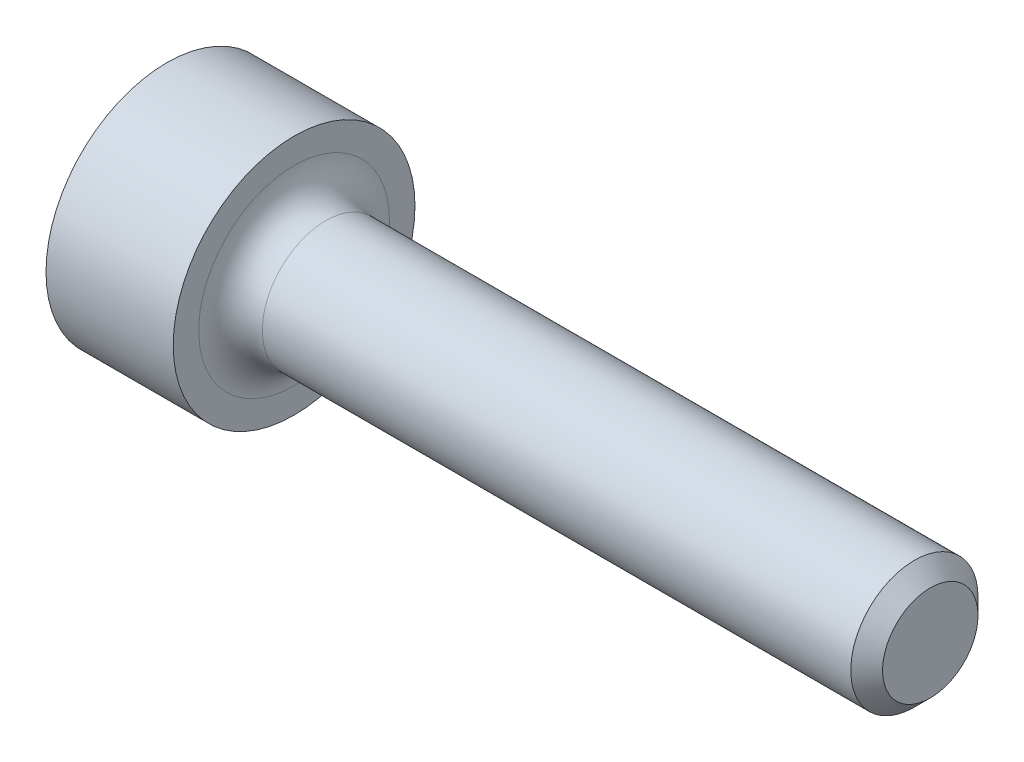
ISO-10303-21;
HEADER;
FILE_DESCRIPTION(('STEP AP214'),'2;1');
FILE_NAME('part.step','',(''),(''),'','','');
FILE_SCHEMA(('AUTOMOTIVE_DESIGN { 1 0 10303 214 1 1 1 1 }'));
ENDSEC;
DATA;
#1=APPLICATION_CONTEXT('core data for automotive mechanical design processes');
#2=APPLICATION_PROTOCOL_DEFINITION('international standard','automotive_design',2000,#1);
#3=PRODUCT_CONTEXT('',#1,'mechanical');
#4=PRODUCT('Part','Part','',(#3));
#5=PRODUCT_RELATED_PRODUCT_CATEGORY('part','',(#4));
#6=PRODUCT_DEFINITION_FORMATION('','',#4);
#7=PRODUCT_DEFINITION_CONTEXT('part definition',#1,'design');
#8=PRODUCT_DEFINITION('design','',#6,#7);
#9=PRODUCT_DEFINITION_SHAPE('','',#8);
#10=(LENGTH_UNIT() NAMED_UNIT(*) SI_UNIT(.MILLI.,.METRE.));
#11=(NAMED_UNIT(*) PLANE_ANGLE_UNIT() SI_UNIT($,.RADIAN.));
#12=(NAMED_UNIT(*) SI_UNIT($,.STERADIAN.) SOLID_ANGLE_UNIT());
#13=UNCERTAINTY_MEASURE_WITH_UNIT(LENGTH_MEASURE(1.E-05),#10,'distance_accuracy_value','');
#14=(GEOMETRIC_REPRESENTATION_CONTEXT(3) GLOBAL_UNCERTAINTY_ASSIGNED_CONTEXT((#13)) GLOBAL_UNIT_ASSIGNED_CONTEXT((#10,
#11,#12)) REPRESENTATION_CONTEXT('',''));
#15=CARTESIAN_POINT('',(0.,0.,0.));
#16=DIRECTION('',(0.,0.,1.));
#17=DIRECTION('',(1.,0.,0.));
#18=AXIS2_PLACEMENT_3D('',#15,#16,#17);
#19=CARTESIAN_POINT('',(12.,0.,0.));
#20=DIRECTION('',(1.,0.,0.));
#21=DIRECTION('',(0.,0.,-1.));
#22=AXIS2_PLACEMENT_3D('',#19,#20,#21);
#23=PLANE('',#22);
#24=CARTESIAN_POINT('',(12.,0.,0.));
#25=DIRECTION('',(1.,0.,0.));
#26=DIRECTION('',(0.,0.,-1.));
#27=AXIS2_PLACEMENT_3D('',#24,#25,#26);
#28=CIRCLE('',#27,0.750000000000001);
#29=CARTESIAN_POINT('',(12.,0.,-0.750000000000001));
#30=VERTEX_POINT('',#29);
#31=EDGE_CURVE('E11',#30,#30,#28,.T.);
#32=ORIENTED_EDGE('',*,*,#31,.T.);
#33=EDGE_LOOP('',(#32));
#34=FACE_BOUND('',#33,.T.);
#35=ADVANCED_FACE('F36',(#34),#23,.T.);
#36=CARTESIAN_POINT('',(0.,0.,0.));
#37=DIRECTION('',(-1.,0.,0.));
#38=DIRECTION('',(0.,0.,1.));
#39=AXIS2_PLACEMENT_3D('',#36,#37,#38);
#40=CYLINDRICAL_SURFACE('',#39,1.);
#41=CARTESIAN_POINT('',(11.75,0.,0.));
#42=DIRECTION('',(1.,0.,0.));
#43=DIRECTION('',(0.,0.,-1.));
#44=AXIS2_PLACEMENT_3D('',#41,#42,#43);
#45=CIRCLE('',#44,1.);
#46=CARTESIAN_POINT('',(11.75,0.,-1.));
#47=VERTEX_POINT('',#46);
#48=EDGE_CURVE('E44',#47,#47,#45,.F.);
#49=ORIENTED_EDGE('',*,*,#48,.T.);
#50=EDGE_LOOP('',(#49));
#51=FACE_BOUND('',#50,.T.);
#52=CARTESIAN_POINT('',(2.5,0.,0.));
#53=DIRECTION('',(1.,0.,0.));
#54=DIRECTION('',(0.,0.,-1.));
#55=AXIS2_PLACEMENT_3D('',#52,#53,#54);
#56=CIRCLE('',#55,1.);
#57=CARTESIAN_POINT('',(2.5,0.,-1.));
#58=VERTEX_POINT('',#57);
#59=EDGE_CURVE('E130',#58,#58,#56,.T.);
#60=ORIENTED_EDGE('',*,*,#59,.T.);
#61=EDGE_LOOP('',(#60));
#62=FACE_BOUND('',#61,.T.);
#63=ADVANCED_FACE('F135',(#51,#62),#40,.T.);
#64=CARTESIAN_POINT('',(2.,-1.9,0.));
#65=DIRECTION('',(1.,0.,0.));
#66=DIRECTION('',(0.,0.,-1.));
#67=AXIS2_PLACEMENT_3D('',#64,#65,#66);
#68=PLANE('',#67);
#69=CARTESIAN_POINT('',(2.,0.,0.));
#70=DIRECTION('',(1.,0.,0.));
#71=DIRECTION('',(0.,0.,-1.));
#72=AXIS2_PLACEMENT_3D('',#69,#70,#71);
#73=CIRCLE('',#72,1.5);
#74=CARTESIAN_POINT('',(2.,0.,-1.5));
#75=VERTEX_POINT('',#74);
#76=EDGE_CURVE('E127',#75,#75,#73,.F.);
#77=ORIENTED_EDGE('',*,*,#76,.T.);
#78=EDGE_LOOP('',(#77));
#79=FACE_BOUND('',#78,.T.);
#80=CARTESIAN_POINT('',(2.,0.,0.));
#81=DIRECTION('',(-1.,0.,0.));
#82=DIRECTION('',(0.,0.,1.));
#83=AXIS2_PLACEMENT_3D('',#80,#81,#82);
#84=CIRCLE('',#83,1.9);
#85=CARTESIAN_POINT('',(2.,0.,1.9));
#86=VERTEX_POINT('',#85);
#87=EDGE_CURVE('E124',#86,#86,#84,.T.);
#88=ORIENTED_EDGE('',*,*,#87,.F.);
#89=EDGE_LOOP('',(#88));
#90=FACE_BOUND('',#89,.T.);
#91=ADVANCED_FACE('F154',(#79,#90),#68,.T.);
#92=CARTESIAN_POINT('',(0.,0.,0.));
#93=DIRECTION('',(-1.,0.,0.));
#94=DIRECTION('',(0.,0.,1.));
#95=AXIS2_PLACEMENT_3D('',#92,#93,#94);
#96=CYLINDRICAL_SURFACE('',#95,1.9);
#97=ORIENTED_EDGE('',*,*,#87,.T.);
#98=EDGE_LOOP('',(#97));
#99=FACE_BOUND('',#98,.T.);
#100=CARTESIAN_POINT('',(0.,0.,0.));
#101=DIRECTION('',(-1.,0.,0.));
#102=DIRECTION('',(0.,0.,1.));
#103=AXIS2_PLACEMENT_3D('',#100,#101,#102);
#104=CIRCLE('',#103,1.9);
#105=CARTESIAN_POINT('',(0.,0.,1.9));
#106=VERTEX_POINT('',#105);
#107=EDGE_CURVE('E113',#106,#106,#104,.T.);
#108=ORIENTED_EDGE('',*,*,#107,.F.);
#109=EDGE_LOOP('',(#108));
#110=FACE_BOUND('',#109,.T.);
#111=ADVANCED_FACE('F166',(#99,#110),#96,.T.);
#112=CARTESIAN_POINT('',(0.,0.,0.));
#113=DIRECTION('',(-1.,0.,0.));
#114=DIRECTION('',(0.,0.,1.));
#115=AXIS2_PLACEMENT_3D('',#112,#113,#114);
#116=PLANE('',#115);
#117=DIRECTION('',(0.,0.5,-0.866025403784439));
#118=VECTOR('',#117,1.);
#119=CARTESIAN_POINT('',(0.,0.43301270189222,0.749999999999999));
#120=LINE('',#119,#118);
#121=CARTESIAN_POINT('',(0.,0.43301270189222,0.749999999999999));
#122=VERTEX_POINT('',#121);
#123=CARTESIAN_POINT('',(0.,0.866025403784439,0.));
#124=VERTEX_POINT('',#123);
#125=EDGE_CURVE('E51',#122,#124,#120,.T.);
#126=ORIENTED_EDGE('',*,*,#125,.F.);
#127=DIRECTION('',(0.,1.,0.));
#128=VECTOR('',#127,1.);
#129=CARTESIAN_POINT('',(0.,-0.433012701892219,0.75));
#130=LINE('',#129,#128);
#131=CARTESIAN_POINT('',(0.,-0.433012701892219,0.75));
#132=VERTEX_POINT('',#131);
#133=EDGE_CURVE('E86',#132,#122,#130,.T.);
#134=ORIENTED_EDGE('',*,*,#133,.F.);
#135=DIRECTION('',(0.,0.5,0.866025403784439));
#136=VECTOR('',#135,1.);
#137=CARTESIAN_POINT('',(0.,-0.866025403784438,0.));
#138=LINE('',#137,#136);
#139=CARTESIAN_POINT('',(0.,-0.866025403784438,0.));
#140=VERTEX_POINT('',#139);
#141=EDGE_CURVE('E95',#140,#132,#138,.T.);
#142=ORIENTED_EDGE('',*,*,#141,.F.);
#143=DIRECTION('',(0.,-0.5,0.866025403784439));
#144=VECTOR('',#143,1.);
#145=CARTESIAN_POINT('',(0.,-0.433012701892219,-0.75));
#146=LINE('',#145,#144);
#147=CARTESIAN_POINT('',(0.,-0.433012701892219,-0.75));
#148=VERTEX_POINT('',#147);
#149=EDGE_CURVE('E101',#148,#140,#146,.T.);
#150=ORIENTED_EDGE('',*,*,#149,.F.);
#151=DIRECTION('',(0.,-1.,0.));
#152=VECTOR('',#151,1.);
#153=CARTESIAN_POINT('',(0.,0.433012701892219,-0.75));
#154=LINE('',#153,#152);
#155=CARTESIAN_POINT('',(0.,0.433012701892219,-0.75));
#156=VERTEX_POINT('',#155);
#157=EDGE_CURVE('E244',#156,#148,#154,.T.);
#158=ORIENTED_EDGE('',*,*,#157,.F.);
#159=DIRECTION('',(0.,-0.5,-0.866025403784438));
#160=VECTOR('',#159,1.);
#161=CARTESIAN_POINT('',(0.,0.866025403784439,0.));
#162=LINE('',#161,#160);
#163=EDGE_CURVE('E242',#124,#156,#162,.T.);
#164=ORIENTED_EDGE('',*,*,#163,.F.);
#165=EDGE_LOOP('',(#126,#134,#142,#150,#158,#164));
#166=FACE_BOUND('',#165,.T.);
#167=ORIENTED_EDGE('',*,*,#107,.T.);
#168=EDGE_LOOP('',(#167));
#169=FACE_BOUND('',#168,.T.);
#170=ADVANCED_FACE('F103',(#166,#169),#116,.T.);
#171=CARTESIAN_POINT('',(2.5,0.,0.));
#172=DIRECTION('',(1.,0.,0.));
#173=DIRECTION('',(0.,0.,-1.));
#174=AXIS2_PLACEMENT_3D('',#171,#172,#173);
#175=TOROIDAL_SURFACE('',#174,1.5,0.5);
#176=ORIENTED_EDGE('',*,*,#59,.F.);
#177=EDGE_LOOP('',(#176));
#178=FACE_BOUND('',#177,.T.);
#179=ORIENTED_EDGE('',*,*,#76,.F.);
#180=EDGE_LOOP('',(#179));
#181=FACE_BOUND('',#180,.T.);
#182=ADVANCED_FACE('F157',(#178,#181),#175,.F.);
#183=CARTESIAN_POINT('',(1.,0.43301270189222,0.749999999999999));
#184=DIRECTION('',(0.,0.866025403784439,0.5));
#185=DIRECTION('',(0.,-0.5,0.866025403784439));
#186=AXIS2_PLACEMENT_3D('',#183,#184,#185);
#187=PLANE('',#186);
#188=ORIENTED_EDGE('',*,*,#125,.T.);
#189=DIRECTION('',(-1.,0.,0.));
#190=VECTOR('',#189,1.);
#191=CARTESIAN_POINT('',(1.,0.866025403784439,0.));
#192=LINE('',#191,#190);
#193=CARTESIAN_POINT('',(1.,0.866025403784439,0.));
#194=VERTEX_POINT('',#193);
#195=EDGE_CURVE('E120',#194,#124,#192,.T.);
#196=ORIENTED_EDGE('',*,*,#195,.F.);
#197=DIRECTION('',(0.,0.5,-0.866025403784439));
#198=VECTOR('',#197,1.);
#199=CARTESIAN_POINT('',(1.,0.43301270189222,0.749999999999999));
#200=LINE('',#199,#198);
#201=CARTESIAN_POINT('',(1.,0.43301270189222,0.749999999999999));
#202=VERTEX_POINT('',#201);
#203=EDGE_CURVE('E106',#202,#194,#200,.T.);
#204=ORIENTED_EDGE('',*,*,#203,.F.);
#205=DIRECTION('',(-1.,0.,0.));
#206=VECTOR('',#205,1.);
#207=CARTESIAN_POINT('',(1.,0.43301270189222,0.749999999999999));
#208=LINE('',#207,#206);
#209=EDGE_CURVE('E91',#202,#122,#208,.T.);
#210=ORIENTED_EDGE('',*,*,#209,.T.);
#211=EDGE_LOOP('',(#188,#196,#204,#210));
#212=FACE_BOUND('',#211,.T.);
#213=ADVANCED_FACE('F159',(#212),#187,.F.);
#214=CARTESIAN_POINT('',(1.,-0.433012701892219,0.75));
#215=DIRECTION('',(0.,0.,1.));
#216=DIRECTION('',(0.,-1.,0.));
#217=AXIS2_PLACEMENT_3D('',#214,#215,#216);
#218=PLANE('',#217);
#219=ORIENTED_EDGE('',*,*,#133,.T.);
#220=ORIENTED_EDGE('',*,*,#209,.F.);
#221=DIRECTION('',(0.,1.,0.));
#222=VECTOR('',#221,1.);
#223=CARTESIAN_POINT('',(1.,-0.433012701892219,0.75));
#224=LINE('',#223,#222);
#225=CARTESIAN_POINT('',(1.,-0.433012701892219,0.75));
#226=VERTEX_POINT('',#225);
#227=EDGE_CURVE('E88',#226,#202,#224,.T.);
#228=ORIENTED_EDGE('',*,*,#227,.F.);
#229=DIRECTION('',(-1.,0.,0.));
#230=VECTOR('',#229,1.);
#231=CARTESIAN_POINT('',(1.,-0.433012701892219,0.75));
#232=LINE('',#231,#230);
#233=EDGE_CURVE('E81',#226,#132,#232,.T.);
#234=ORIENTED_EDGE('',*,*,#233,.T.);
#235=EDGE_LOOP('',(#219,#220,#228,#234));
#236=FACE_BOUND('',#235,.T.);
#237=ADVANCED_FACE('F83',(#236),#218,.F.);
#238=CARTESIAN_POINT('',(1.,-0.866025403784438,0.));
#239=DIRECTION('',(0.,-0.866025403784439,0.5));
#240=DIRECTION('',(0.,-0.5,-0.866025403784439));
#241=AXIS2_PLACEMENT_3D('',#238,#239,#240);
#242=PLANE('',#241);
#243=ORIENTED_EDGE('',*,*,#141,.T.);
#244=ORIENTED_EDGE('',*,*,#233,.F.);
#245=DIRECTION('',(0.,0.5,0.866025403784439));
#246=VECTOR('',#245,1.);
#247=CARTESIAN_POINT('',(1.,-0.866025403784438,0.));
#248=LINE('',#247,#246);
#249=CARTESIAN_POINT('',(1.,-0.866025403784438,0.));
#250=VERTEX_POINT('',#249);
#251=EDGE_CURVE('E237',#250,#226,#248,.T.);
#252=ORIENTED_EDGE('',*,*,#251,.F.);
#253=DIRECTION('',(-1.,0.,0.));
#254=VECTOR('',#253,1.);
#255=CARTESIAN_POINT('',(1.,-0.866025403784438,0.));
#256=LINE('',#255,#254);
#257=EDGE_CURVE('E92',#250,#140,#256,.T.);
#258=ORIENTED_EDGE('',*,*,#257,.T.);
#259=EDGE_LOOP('',(#243,#244,#252,#258));
#260=FACE_BOUND('',#259,.T.);
#261=ADVANCED_FACE('F96',(#260),#242,.F.);
#262=CARTESIAN_POINT('',(1.,-0.433012701892219,-0.75));
#263=DIRECTION('',(0.,-0.866025403784439,-0.5));
#264=DIRECTION('',(0.,0.5,-0.866025403784439));
#265=AXIS2_PLACEMENT_3D('',#262,#263,#264);
#266=PLANE('',#265);
#267=ORIENTED_EDGE('',*,*,#149,.T.);
#268=ORIENTED_EDGE('',*,*,#257,.F.);
#269=DIRECTION('',(0.,-0.5,0.866025403784439));
#270=VECTOR('',#269,1.);
#271=CARTESIAN_POINT('',(1.,-0.433012701892219,-0.75));
#272=LINE('',#271,#270);
#273=CARTESIAN_POINT('',(1.,-0.433012701892219,-0.75));
#274=VERTEX_POINT('',#273);
#275=EDGE_CURVE('E232',#274,#250,#272,.T.);
#276=ORIENTED_EDGE('',*,*,#275,.F.);
#277=DIRECTION('',(-1.,0.,0.));
#278=VECTOR('',#277,1.);
#279=CARTESIAN_POINT('',(1.,-0.433012701892219,-0.75));
#280=LINE('',#279,#278);
#281=EDGE_CURVE('E116',#274,#148,#280,.T.);
#282=ORIENTED_EDGE('',*,*,#281,.T.);
#283=EDGE_LOOP('',(#267,#268,#276,#282));
#284=FACE_BOUND('',#283,.T.);
#285=ADVANCED_FACE('F191',(#284),#266,.F.);
#286=CARTESIAN_POINT('',(1.,0.433012701892219,-0.75));
#287=DIRECTION('',(0.,0.,-1.));
#288=DIRECTION('',(0.,1.,0.));
#289=AXIS2_PLACEMENT_3D('',#286,#287,#288);
#290=PLANE('',#289);
#291=ORIENTED_EDGE('',*,*,#157,.T.);
#292=ORIENTED_EDGE('',*,*,#281,.F.);
#293=DIRECTION('',(0.,-1.,0.));
#294=VECTOR('',#293,1.);
#295=CARTESIAN_POINT('',(1.,0.433012701892219,-0.75));
#296=LINE('',#295,#294);
#297=CARTESIAN_POINT('',(1.,0.433012701892219,-0.75));
#298=VERTEX_POINT('',#297);
#299=EDGE_CURVE('E229',#298,#274,#296,.T.);
#300=ORIENTED_EDGE('',*,*,#299,.F.);
#301=DIRECTION('',(-1.,0.,0.));
#302=VECTOR('',#301,1.);
#303=CARTESIAN_POINT('',(1.,0.433012701892219,-0.75));
#304=LINE('',#303,#302);
#305=EDGE_CURVE('E118',#298,#156,#304,.T.);
#306=ORIENTED_EDGE('',*,*,#305,.T.);
#307=EDGE_LOOP('',(#291,#292,#300,#306));
#308=FACE_BOUND('',#307,.T.);
#309=ADVANCED_FACE('F187',(#308),#290,.F.);
#310=CARTESIAN_POINT('',(1.,0.866025403784439,0.));
#311=DIRECTION('',(0.,0.866025403784438,-0.5));
#312=DIRECTION('',(0.,0.5,0.866025403784439));
#313=AXIS2_PLACEMENT_3D('',#310,#311,#312);
#314=PLANE('',#313);
#315=ORIENTED_EDGE('',*,*,#163,.T.);
#316=ORIENTED_EDGE('',*,*,#305,.F.);
#317=DIRECTION('',(0.,-0.5,-0.866025403784438));
#318=VECTOR('',#317,1.);
#319=CARTESIAN_POINT('',(1.,0.866025403784439,0.));
#320=LINE('',#319,#318);
#321=EDGE_CURVE('E109',#194,#298,#320,.T.);
#322=ORIENTED_EDGE('',*,*,#321,.F.);
#323=ORIENTED_EDGE('',*,*,#195,.T.);
#324=EDGE_LOOP('',(#315,#316,#322,#323));
#325=FACE_BOUND('',#324,.T.);
#326=ADVANCED_FACE('F183',(#325),#314,.F.);
#327=CARTESIAN_POINT('',(1.,-0.866025403784438,0.));
#328=DIRECTION('',(-1.,0.,0.));
#329=DIRECTION('',(0.,0.,1.));
#330=AXIS2_PLACEMENT_3D('',#327,#328,#329);
#331=PLANE('',#330);
#332=CARTESIAN_POINT('',(1.,0.,0.));
#333=DIRECTION('',(-1.,0.,0.));
#334=DIRECTION('',(0.,0.,1.));
#335=AXIS2_PLACEMENT_3D('',#332,#333,#334);
#336=CIRCLE('',#335,0.866025403784438);
#337=EDGE_CURVE('E60',#202,#194,#336,.T.);
#338=ORIENTED_EDGE('',*,*,#337,.F.);
#339=ORIENTED_EDGE('',*,*,#203,.T.);
#340=EDGE_LOOP('',(#338,#339));
#341=FACE_BOUND('',#340,.T.);
#342=ADVANCED_FACE('F186',(#341),#331,.F.);
#343=EDGE_CURVE('E260',#226,#202,#336,.T.);
#344=ORIENTED_EDGE('',*,*,#343,.F.);
#345=ORIENTED_EDGE('',*,*,#227,.T.);
#346=EDGE_LOOP('',(#344,#345));
#347=FACE_BOUND('',#346,.T.);
#348=ADVANCED_FACE('F201',(#347),#331,.F.);
#349=EDGE_CURVE('E259',#250,#226,#336,.T.);
#350=ORIENTED_EDGE('',*,*,#349,.F.);
#351=ORIENTED_EDGE('',*,*,#251,.T.);
#352=EDGE_LOOP('',(#350,#351));
#353=FACE_BOUND('',#352,.T.);
#354=ADVANCED_FACE('F206',(#353),#331,.F.);
#355=EDGE_CURVE('E256',#274,#250,#336,.T.);
#356=ORIENTED_EDGE('',*,*,#355,.F.);
#357=ORIENTED_EDGE('',*,*,#275,.T.);
#358=EDGE_LOOP('',(#356,#357));
#359=FACE_BOUND('',#358,.T.);
#360=ADVANCED_FACE('F214',(#359),#331,.F.);
#361=EDGE_CURVE('E223',#298,#274,#336,.T.);
#362=ORIENTED_EDGE('',*,*,#361,.F.);
#363=ORIENTED_EDGE('',*,*,#299,.T.);
#364=EDGE_LOOP('',(#362,#363));
#365=FACE_BOUND('',#364,.T.);
#366=ADVANCED_FACE('F209',(#365),#331,.F.);
#367=EDGE_CURVE('E217',#194,#298,#336,.T.);
#368=ORIENTED_EDGE('',*,*,#367,.F.);
#369=ORIENTED_EDGE('',*,*,#321,.T.);
#370=EDGE_LOOP('',(#368,#369));
#371=FACE_BOUND('',#370,.T.);
#372=ADVANCED_FACE('F144',(#371),#331,.F.);
#373=CARTESIAN_POINT('',(1.,0.,0.));
#374=DIRECTION('',(-1.,0.,0.));
#375=DIRECTION('',(0.,0.,1.));
#376=AXIS2_PLACEMENT_3D('',#373,#374,#375);
#377=CONICAL_SURFACE('',#376,0.866025403784438,1.04719755119659);
#378=CARTESIAN_POINT('',(1.50000000000001,0.,0.));
#379=VERTEX_POINT('',#378);
#380=VERTEX_LOOP('',#379);
#381=FACE_BOUND('',#380,.T.);
#382=ORIENTED_EDGE('',*,*,#337,.T.);
#383=ORIENTED_EDGE('',*,*,#367,.T.);
#384=ORIENTED_EDGE('',*,*,#361,.T.);
#385=ORIENTED_EDGE('',*,*,#355,.T.);
#386=ORIENTED_EDGE('',*,*,#349,.T.);
#387=ORIENTED_EDGE('',*,*,#343,.T.);
#388=EDGE_LOOP('',(#382,#383,#384,#385,#386,#387));
#389=FACE_BOUND('',#388,.T.);
#390=ADVANCED_FACE('F139',(#381,#389),#377,.F.);
#391=CARTESIAN_POINT('',(11.75,0.,0.));
#392=DIRECTION('',(-1.,0.,0.));
#393=DIRECTION('',(0.,0.,1.));
#394=AXIS2_PLACEMENT_3D('',#391,#392,#393);
#395=CONICAL_SURFACE('',#394,1.,0.785398163397453);
#396=ORIENTED_EDGE('',*,*,#31,.F.);
#397=EDGE_LOOP('',(#396));
#398=FACE_BOUND('',#397,.T.);
#399=ORIENTED_EDGE('',*,*,#48,.F.);
#400=EDGE_LOOP('',(#399));
#401=FACE_BOUND('',#400,.T.);
#402=ADVANCED_FACE('F38',(#398,#401),#395,.T.);
#403=CLOSED_SHELL('',(#35,#63,#91,#111,#170,#182,#213,#237,#261,#285,#309,#326,#342,#348,#354,
#360,#366,#372,#390,#402));
#404=MANIFOLD_SOLID_BREP('B2',#403);
#405=ADVANCED_BREP_SHAPE_REPRESENTATION('',(#18,#404),#14);
#406=SHAPE_DEFINITION_REPRESENTATION(#9,#405);
ENDSEC;
END-ISO-10303-21;
